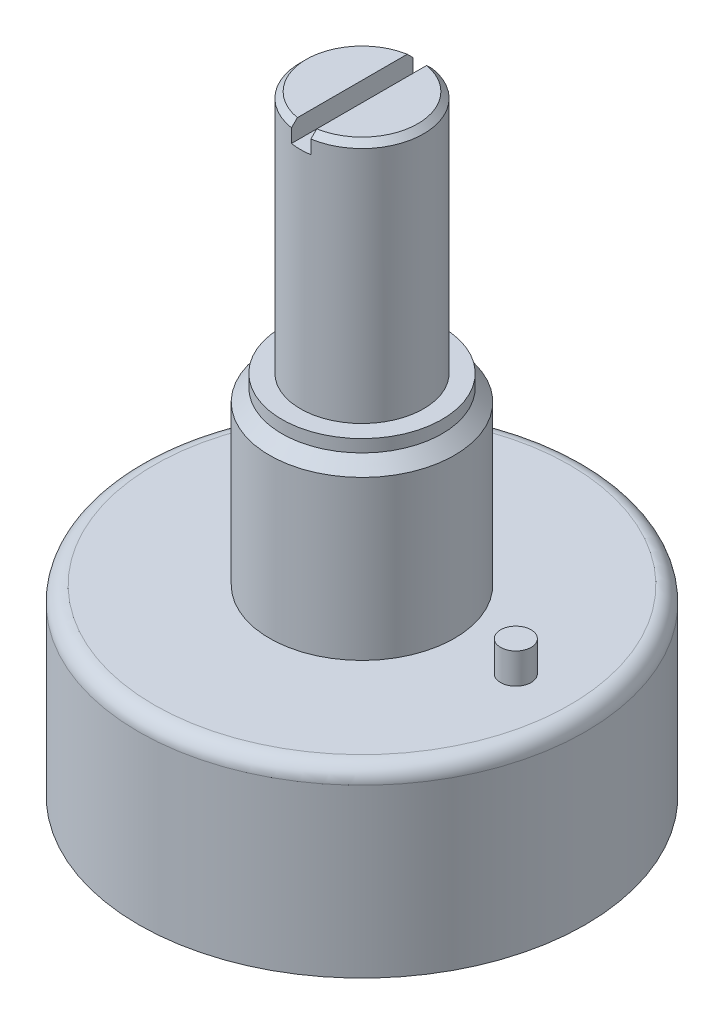
ISO-10303-21;
HEADER;
FILE_DESCRIPTION(('STEP AP214'),'2;1');
FILE_NAME('part.step','',(''),(''),'','','');
FILE_SCHEMA(('AUTOMOTIVE_DESIGN { 1 0 10303 214 1 1 1 1 }'));
ENDSEC;
DATA;
#1=APPLICATION_CONTEXT('core data for automotive mechanical design processes');
#2=APPLICATION_PROTOCOL_DEFINITION('international standard','automotive_design',2000,#1);
#3=PRODUCT_CONTEXT('',#1,'mechanical');
#4=PRODUCT('Part','Part','',(#3));
#5=PRODUCT_RELATED_PRODUCT_CATEGORY('part','',(#4));
#6=PRODUCT_DEFINITION_FORMATION('','',#4);
#7=PRODUCT_DEFINITION_CONTEXT('part definition',#1,'design');
#8=PRODUCT_DEFINITION('design','',#6,#7);
#9=PRODUCT_DEFINITION_SHAPE('','',#8);
#10=(LENGTH_UNIT() NAMED_UNIT(*) SI_UNIT(.MILLI.,.METRE.));
#11=(NAMED_UNIT(*) PLANE_ANGLE_UNIT() SI_UNIT($,.RADIAN.));
#12=(NAMED_UNIT(*) SI_UNIT($,.STERADIAN.) SOLID_ANGLE_UNIT());
#13=UNCERTAINTY_MEASURE_WITH_UNIT(LENGTH_MEASURE(1.E-05),#10,'distance_accuracy_value','');
#14=(GEOMETRIC_REPRESENTATION_CONTEXT(3) GLOBAL_UNCERTAINTY_ASSIGNED_CONTEXT((#13)) GLOBAL_UNIT_ASSIGNED_CONTEXT((#10,
#11,#12)) REPRESENTATION_CONTEXT('',''));
#15=CARTESIAN_POINT('',(0.,0.,0.));
#16=DIRECTION('',(0.,0.,1.));
#17=DIRECTION('',(1.,0.,0.));
#18=AXIS2_PLACEMENT_3D('',#15,#16,#17);
#19=CARTESIAN_POINT('',(0.,31.4,0.));
#20=DIRECTION('',(0.,-1.,0.));
#21=DIRECTION('',(0.,0.,-1.));
#22=AXIS2_PLACEMENT_3D('',#19,#20,#21);
#23=PLANE('',#22);
#24=CARTESIAN_POINT('',(0.,31.4,0.));
#25=DIRECTION('',(0.,-1.,0.));
#26=DIRECTION('',(0.,0.,-1.));
#27=AXIS2_PLACEMENT_3D('',#24,#25,#26);
#28=CIRCLE('',#27,2.87249999999998);
#29=CARTESIAN_POINT('',(-0.5,31.4,-2.82864919175211));
#30=VERTEX_POINT('',#29);
#31=CARTESIAN_POINT('',(-0.5,31.4,2.82864919175211));
#32=VERTEX_POINT('',#31);
#33=EDGE_CURVE('E101',#30,#32,#28,.F.);
#34=ORIENTED_EDGE('',*,*,#33,.T.);
#35=DIRECTION('',(0.,0.,1.));
#36=VECTOR('',#35,1.);
#37=CARTESIAN_POINT('',(-0.5,31.4,3.28597428225304));
#38=LINE('',#37,#36);
#39=EDGE_CURVE('E90',#30,#32,#38,.T.);
#40=ORIENTED_EDGE('',*,*,#39,.F.);
#41=EDGE_LOOP('',(#34,#40));
#42=FACE_BOUND('',#41,.T.);
#43=ADVANCED_FACE('F36',(#42),#23,.F.);
#44=CARTESIAN_POINT('',(0.,31.1,0.));
#45=DIRECTION('',(0.,-1.,0.));
#46=DIRECTION('',(0.,0.,-1.));
#47=AXIS2_PLACEMENT_3D('',#44,#45,#46);
#48=CONICAL_SURFACE('',#47,3.1725,0.785398163397445);
#49=CARTESIAN_POINT('',(-0.5,27.288547056413,-6.96603177700447));
#50=CARTESIAN_POINT('',(-0.5,27.5300039597457,-6.72394862889892));
#51=CARTESIAN_POINT('',(-0.5,27.771433315518,-6.48183798201227));
#52=CARTESIAN_POINT('',(-0.5,28.2542078267142,-5.9975188207773));
#53=CARTESIAN_POINT('',(-0.5,28.4955529795056,-5.75531030380489));
#54=CARTESIAN_POINT('',(-0.5,28.9782776286299,-5.2706042479382));
#55=CARTESIAN_POINT('',(-0.5,29.2196570397063,-5.02810662411767));
#56=CARTESIAN_POINT('',(-0.5,29.7022134935406,-4.54292366184228));
#57=CARTESIAN_POINT('',(-0.5,29.9433905418,-4.30023832885955));
#58=CARTESIAN_POINT('',(-0.5,30.4238625517319,-3.8161367390831));
#59=CARTESIAN_POINT('',(-0.5,30.6631595469871,-3.57472250216536));
#60=CARTESIAN_POINT('',(-0.5,31.0216934581403,-3.21217326344738));
#61=CARTESIAN_POINT('',(-0.5,31.1411413385245,-3.09124694733634));
#62=CARTESIAN_POINT('',(-0.5,31.3798344307671,-2.84919646474488));
#63=CARTESIAN_POINT('',(-0.5,31.4990796443604,-2.72807229997575));
#64=CARTESIAN_POINT('',(-0.5,31.7372267306625,-2.48558553315032));
#65=CARTESIAN_POINT('',(-0.5,31.8561287255236,-2.36422305118749));
#66=CARTESIAN_POINT('',(-0.5,32.0934778662436,-2.12104623578978));
#67=CARTESIAN_POINT('',(-0.5,32.2119249969633,-1.99923188757616));
#68=CARTESIAN_POINT('',(-0.5,32.4480480006189,-1.75489048668165));
#69=CARTESIAN_POINT('',(-0.5,32.5657239876176,-1.63236354470605));
#70=CARTESIAN_POINT('',(-0.5,32.741151467923,-1.44754709102771));
#71=CARTESIAN_POINT('',(-0.5,32.7994446647636,-1.38577226776808));
#72=CARTESIAN_POINT('',(-0.5,32.9154966415272,-1.26172319205674));
#73=CARTESIAN_POINT('',(-0.5,32.9732554319675,-1.19944894947908));
#74=CARTESIAN_POINT('',(-0.5,33.0619346470259,-1.10256782524118));
#75=CARTESIAN_POINT('',(-0.5,33.0931437868164,-1.06822540774064));
#76=CARTESIAN_POINT('',(-0.5,33.1552403987732,-0.999247494692473));
#77=CARTESIAN_POINT('',(-0.5,33.186127855638,-0.964611985343962));
#78=CARTESIAN_POINT('',(-0.5,33.2475411637469,-0.894882169528603));
#79=CARTESIAN_POINT('',(-0.5,33.278066042011,-0.859787004297246));
#80=CARTESIAN_POINT('',(-0.5,33.3385167604402,-0.789089245899828));
#81=CARTESIAN_POINT('',(-0.5,33.3684426687403,-0.753486711246776));
#82=CARTESIAN_POINT('',(-0.5,33.4239970578936,-0.685774653073547));
#83=CARTESIAN_POINT('',(-0.5,33.4497194321187,-0.653742467464993));
#84=CARTESIAN_POINT('',(-0.5,33.500209873413,-0.588936300757677));
#85=CARTESIAN_POINT('',(-0.5,33.5249780769624,-0.55616242681932));
#86=CARTESIAN_POINT('',(-0.5,33.5730721409335,-0.489621331310184));
#87=CARTESIAN_POINT('',(-0.5,33.596399647672,-0.455855311164393));
#88=CARTESIAN_POINT('',(-0.5,33.6408348341534,-0.386908383343045));
#89=CARTESIAN_POINT('',(-0.5,33.6619447838647,-0.351728974494393));
#90=CARTESIAN_POINT('',(-0.5,33.6981438156599,-0.283904257322551));
#91=CARTESIAN_POINT('',(-0.5,33.7136554485617,-0.251490074209695));
#92=CARTESIAN_POINT('',(-0.5,33.7402696284194,-0.184909435055523));
#93=CARTESIAN_POINT('',(-0.5,33.7513848493789,-0.150748341343978));
#94=CARTESIAN_POINT('',(-0.5,33.7657373860242,-0.0870991771249009));
#95=CARTESIAN_POINT('',(-0.5,33.7700232182639,-0.0578586677211615));
#96=CARTESIAN_POINT('',(-0.5,33.7733563825789,0.000907523195942696));
#97=CARTESIAN_POINT('',(-0.5,33.7724095526789,0.0304328502273533));
#98=CARTESIAN_POINT('',(-0.5,33.7655167295567,0.0887201584695105));
#99=CARTESIAN_POINT('',(-0.5,33.7595935146516,0.11748500289242));
#100=CARTESIAN_POINT('',(-0.5,33.7438123198258,0.173922650467285));
#101=CARTESIAN_POINT('',(-0.5,33.7339463524022,0.20159311071396));
#102=CARTESIAN_POINT('',(-0.5,33.7054207568807,0.270216672487378));
#103=CARTESIAN_POINT('',(-0.5,33.684879369701,0.310365635825965));
#104=CARTESIAN_POINT('',(-0.5,33.6400764186486,0.388567737337615));
#105=CARTESIAN_POINT('',(-0.5,33.615804451372,0.426614597103545));
#106=CARTESIAN_POINT('',(-0.5,33.5648318288428,0.501549373047888));
#107=CARTESIAN_POINT('',(-0.5,33.5381105542536,0.538423095660453));
#108=CARTESIAN_POINT('',(-0.5,33.4833104990237,0.611051921840621));
#109=CARTESIAN_POINT('',(-0.5,33.4552336726478,0.646808520182425));
#110=CARTESIAN_POINT('',(-0.5,33.393669800073,0.723138344051769));
#111=CARTESIAN_POINT('',(-0.5,33.3600262966418,0.763584757381936));
#112=CARTESIAN_POINT('',(-0.5,33.2919228337129,0.843786262325022));
#113=CARTESIAN_POINT('',(-0.5,33.2574627975668,0.883541288424836));
#114=CARTESIAN_POINT('',(-0.5,33.1532316596547,1.00209776114756));
#115=CARTESIAN_POINT('',(-0.5,33.0826294694009,1.08016659481256));
#116=CARTESIAN_POINT('',(-0.5,32.9401654433592,1.23532869523354));
#117=CARTESIAN_POINT('',(-0.5,32.8683020448125,1.31242051277037));
#118=CARTESIAN_POINT('',(-0.5,32.7238744451481,1.46591832235309));
#119=CARTESIAN_POINT('',(-0.5,32.6513103723287,1.54232443519188));
#120=CARTESIAN_POINT('',(-0.5,32.5062568807852,1.69413979144439));
#121=CARTESIAN_POINT('',(-0.5,32.4337708058557,1.76955223765962));
#122=CARTESIAN_POINT('',(-0.5,32.2884836271079,1.92007967761313));
#123=CARTESIAN_POINT('',(-0.5,32.2156825087285,1.99519465728884));
#124=CARTESIAN_POINT('',(-0.5,31.9970510964316,2.22011733756257));
#125=CARTESIAN_POINT('',(-0.5,31.8508932072082,2.36960638433859));
#126=CARTESIAN_POINT('',(-0.5,31.5226066767131,2.70429326551709));
#127=CARTESIAN_POINT('',(-0.5,31.3403472655684,2.88936260435475));
#128=CARTESIAN_POINT('',(-0.5,30.9754096072684,3.25909004141369));
#129=CARTESIAN_POINT('',(-0.5,30.7927313573098,3.44374813686612));
#130=CARTESIAN_POINT('',(-0.5,30.2442163996167,3.99745700407354));
#131=CARTESIAN_POINT('',(-0.5,29.8780044215792,4.36613584966918));
#132=CARTESIAN_POINT('',(-0.5,29.1413395544801,5.10688487472396));
#133=CARTESIAN_POINT('',(-0.5,28.7708821118829,5.47895052068311));
#134=CARTESIAN_POINT('',(-0.5,28.0298134335333,6.22270266375583));
#135=CARTESIAN_POINT('',(-0.5,27.6592022790939,6.59438924187605));
#136=CARTESIAN_POINT('',(-0.5,27.288547056413,6.96603177700447));
#137=B_SPLINE_CURVE_WITH_KNOTS('',3,(#49,#50,#51,#52,#53,#54,#55,#56,#57,#58,#59,#60,#61,#62,
#63,#64,#65,#66,#67,#68,#69,#70,#71,#72,#73,#74,#75,#76,#77,#78,#79,#80,#81,#82,#83,#84,#85,#86,
#87,#88,#89,#90,#91,#92,#93,#94,#95,#96,#97,#98,#99,#100,#101,#102,#103,#104,#105,#106,#107,
#108,#109,#110,#111,#112,#113,#114,#115,#116,#117,#118,#119,#120,#121,#122,#123,#124,#125,#126,
#127,#128,#129,#130,#131,#132,#133,#134,#135,#136),.UNSPECIFIED.,.F.,.F.,(4,2,2,2,2,2,2,2,2,2,2,
2,2,2,2,2,2,2,2,2,2,2,2,2,2,2,2,2,2,2,2,2,2,2,2,2,2,2,2,2,2,2,2,4),(0.,1.02574422896252,
2.05151807667026,3.07797893342647,4.10441091666349,5.12416271016263,5.63408285721161,
6.14399861684405,6.65370233825424,7.16342287964467,7.67306624280289,7.9278742770764,
8.18267728588768,8.32189043163663,8.46111016943695,8.60064398553022,8.74016183788523,
8.86339490702947,8.98661028350882,9.10968214938228,9.23262678115715,9.34023855108588,
9.44753779572922,9.53578085263877,9.62392547761077,9.71166882412716,9.79959083572273,
9.93449922665348,10.0697908989564,10.2063498110251,10.3427174088062,10.5005299419243,
10.6583573481386,10.9741057462498,11.2902777212977,11.6063928612655,11.9201933645933,
12.23400852968,12.8612078503918,13.640451616304,14.4197006129891,15.978647158305,
17.5537801263763,19.1284329101131),.UNSPECIFIED.);
#138=CARTESIAN_POINT('',(-0.5,31.1,-3.13285113754229));
#139=VERTEX_POINT('',#138);
#140=EDGE_CURVE('E87',#139,#30,#137,.T.);
#141=ORIENTED_EDGE('',*,*,#140,.F.);
#142=CARTESIAN_POINT('',(0.,31.1,0.));
#143=DIRECTION('',(0.,-1.,0.));
#144=DIRECTION('',(0.,0.,-1.));
#145=AXIS2_PLACEMENT_3D('',#142,#143,#144);
#146=CIRCLE('',#145,3.1725);
#147=CARTESIAN_POINT('',(-0.5,31.1,3.13285113754229));
#148=VERTEX_POINT('',#147);
#149=EDGE_CURVE('E554',#148,#139,#146,.T.);
#150=ORIENTED_EDGE('',*,*,#149,.F.);
#151=EDGE_CURVE('E97',#32,#148,#137,.T.);
#152=ORIENTED_EDGE('',*,*,#151,.F.);
#153=ORIENTED_EDGE('',*,*,#33,.F.);
#154=EDGE_LOOP('',(#141,#150,#152,#153));
#155=FACE_BOUND('',#154,.T.);
#156=ADVANCED_FACE('F104',(#155),#48,.T.);
#157=CARTESIAN_POINT('',(-11.5,0.,0.));
#158=DIRECTION('',(0.,1.,0.));
#159=DIRECTION('',(0.,0.,1.));
#160=AXIS2_PLACEMENT_3D('',#157,#158,#159);
#161=PLANE('',#160);
#162=CARTESIAN_POINT('',(4.5,0.,0.));
#163=DIRECTION('',(0.,1.,0.));
#164=DIRECTION('',(0.,0.,1.));
#165=AXIS2_PLACEMENT_3D('',#162,#163,#164);
#166=CIRCLE('',#165,1.);
#167=CARTESIAN_POINT('',(4.5,0.,1.));
#168=VERTEX_POINT('',#167);
#169=EDGE_CURVE('E11',#168,#168,#166,.F.);
#170=ORIENTED_EDGE('',*,*,#169,.F.);
#171=EDGE_LOOP('',(#170));
#172=FACE_BOUND('',#171,.T.);
#173=CARTESIAN_POINT('',(-3.18198051533948,0.,-3.18198051533946));
#174=DIRECTION('',(0.,1.,0.));
#175=DIRECTION('',(0.,0.,1.));
#176=AXIS2_PLACEMENT_3D('',#173,#174,#175);
#177=CIRCLE('',#176,1.00000000000001);
#178=CARTESIAN_POINT('',(-3.18198051533948,0.,-2.18198051533945));
#179=VERTEX_POINT('',#178);
#180=EDGE_CURVE('E44',#179,#179,#177,.F.);
#181=ORIENTED_EDGE('',*,*,#180,.F.);
#182=EDGE_LOOP('',(#181));
#183=FACE_BOUND('',#182,.T.);
#184=CARTESIAN_POINT('',(-3.18198051533948,0.,3.18198051533946));
#185=DIRECTION('',(0.,1.,0.));
#186=DIRECTION('',(0.,0.,1.));
#187=AXIS2_PLACEMENT_3D('',#184,#185,#186);
#188=CIRCLE('',#187,1.00000000000001);
#189=CARTESIAN_POINT('',(-3.18198051533948,0.,4.18198051533947));
#190=VERTEX_POINT('',#189);
#191=EDGE_CURVE('E654',#190,#190,#188,.F.);
#192=ORIENTED_EDGE('',*,*,#191,.F.);
#193=EDGE_LOOP('',(#192));
#194=FACE_BOUND('',#193,.T.);
#195=CARTESIAN_POINT('',(0.,0.,0.));
#196=DIRECTION('',(0.,-1.,0.));
#197=DIRECTION('',(0.,0.,-1.));
#198=AXIS2_PLACEMENT_3D('',#195,#196,#197);
#199=CIRCLE('',#198,11.5);
#200=CARTESIAN_POINT('',(0.,0.,-11.5));
#201=VERTEX_POINT('',#200);
#202=EDGE_CURVE('E573',#201,#201,#199,.T.);
#203=ORIENTED_EDGE('',*,*,#202,.T.);
#204=EDGE_LOOP('',(#203));
#205=FACE_BOUND('',#204,.T.);
#206=ADVANCED_FACE('F165',(#172,#183,#194,#205),#161,.F.);
#207=CARTESIAN_POINT('',(0.5,31.4,2.82864919175211));
#208=VERTEX_POINT('',#207);
#209=CARTESIAN_POINT('',(0.5,31.4,-2.82864919175211));
#210=VERTEX_POINT('',#209);
#211=EDGE_CURVE('E106',#208,#210,#28,.F.);
#212=ORIENTED_EDGE('',*,*,#211,.T.);
#213=DIRECTION('',(0.,0.,-1.));
#214=VECTOR('',#213,1.);
#215=CARTESIAN_POINT('',(0.5,31.4,3.28597428225304));
#216=LINE('',#215,#214);
#217=EDGE_CURVE('E51',#208,#210,#216,.T.);
#218=ORIENTED_EDGE('',*,*,#217,.F.);
#219=EDGE_LOOP('',(#212,#218));
#220=FACE_BOUND('',#219,.T.);
#221=ADVANCED_FACE('F162',(#220),#23,.F.);
#222=CARTESIAN_POINT('',(0.,0.,0.));
#223=DIRECTION('',(0.,-1.,0.));
#224=DIRECTION('',(0.,0.,-1.));
#225=AXIS2_PLACEMENT_3D('',#222,#223,#224);
#226=CYLINDRICAL_SURFACE('',#225,3.1725);
#227=ORIENTED_EDGE('',*,*,#149,.T.);
#228=DIRECTION('',(0.,-1.,0.));
#229=VECTOR('',#228,1.);
#230=CARTESIAN_POINT('',(-0.5,0.,-3.13285113754229));
#231=LINE('',#230,#229);
#232=CARTESIAN_POINT('',(-0.5,30.4,-3.13285113754229));
#233=VERTEX_POINT('',#232);
#234=EDGE_CURVE('E59',#139,#233,#231,.T.);
#235=ORIENTED_EDGE('',*,*,#234,.T.);
#236=CARTESIAN_POINT('',(0.,30.4,0.));
#237=DIRECTION('',(0.,1.,0.));
#238=DIRECTION('',(0.,0.,1.));
#239=AXIS2_PLACEMENT_3D('',#236,#237,#238);
#240=CIRCLE('',#239,3.1725);
#241=CARTESIAN_POINT('',(0.5,30.4,-3.13285113754229));
#242=VERTEX_POINT('',#241);
#243=EDGE_CURVE('E666',#242,#233,#240,.T.);
#244=ORIENTED_EDGE('',*,*,#243,.F.);
#245=DIRECTION('',(0.,-1.,0.));
#246=VECTOR('',#245,1.);
#247=CARTESIAN_POINT('',(0.5,0.,-3.13285113754229));
#248=LINE('',#247,#246);
#249=CARTESIAN_POINT('',(0.5,31.1,-3.13285113754229));
#250=VERTEX_POINT('',#249);
#251=EDGE_CURVE('E553',#242,#250,#248,.F.);
#252=ORIENTED_EDGE('',*,*,#251,.T.);
#253=CARTESIAN_POINT('',(0.5,31.1,3.13285113754229));
#254=VERTEX_POINT('',#253);
#255=EDGE_CURVE('E111',#250,#254,#146,.T.);
#256=ORIENTED_EDGE('',*,*,#255,.T.);
#257=DIRECTION('',(0.,-1.,0.));
#258=VECTOR('',#257,1.);
#259=CARTESIAN_POINT('',(0.5,0.,3.13285113754229));
#260=LINE('',#259,#258);
#261=CARTESIAN_POINT('',(0.5,30.4,3.13285113754229));
#262=VERTEX_POINT('',#261);
#263=EDGE_CURVE('E551',#254,#262,#260,.T.);
#264=ORIENTED_EDGE('',*,*,#263,.T.);
#265=CARTESIAN_POINT('',(-0.5,30.4,3.13285113754229));
#266=VERTEX_POINT('',#265);
#267=EDGE_CURVE('E96',#266,#262,#240,.T.);
#268=ORIENTED_EDGE('',*,*,#267,.F.);
#269=DIRECTION('',(0.,-1.,0.));
#270=VECTOR('',#269,1.);
#271=CARTESIAN_POINT('',(-0.5,0.,3.13285113754229));
#272=LINE('',#271,#270);
#273=EDGE_CURVE('E577',#266,#148,#272,.F.);
#274=ORIENTED_EDGE('',*,*,#273,.T.);
#275=EDGE_LOOP('',(#227,#235,#244,#252,#256,#264,#268,#274));
#276=FACE_BOUND('',#275,.T.);
#277=CARTESIAN_POINT('',(0.,18.84,0.));
#278=DIRECTION('',(0.,-1.,0.));
#279=DIRECTION('',(0.,0.,-1.));
#280=AXIS2_PLACEMENT_3D('',#277,#278,#279);
#281=CIRCLE('',#280,3.1725);
#282=CARTESIAN_POINT('',(0.,18.84,-3.1725));
#283=VERTEX_POINT('',#282);
#284=EDGE_CURVE('E555',#283,#283,#281,.T.);
#285=ORIENTED_EDGE('',*,*,#284,.F.);
#286=EDGE_LOOP('',(#285));
#287=FACE_BOUND('',#286,.T.);
#288=ADVANCED_FACE('F158',(#276,#287),#226,.T.);
#289=CARTESIAN_POINT('',(-3.1725,18.84,0.));
#290=DIRECTION('',(0.,-1.,0.));
#291=DIRECTION('',(0.,0.,-1.));
#292=AXIS2_PLACEMENT_3D('',#289,#290,#291);
#293=PLANE('',#292);
#294=CARTESIAN_POINT('',(0.,18.84,0.));
#295=DIRECTION('',(0.,-1.,0.));
#296=DIRECTION('',(0.,0.,-1.));
#297=AXIS2_PLACEMENT_3D('',#294,#295,#296);
#298=CIRCLE('',#297,4.12249999999999);
#299=CARTESIAN_POINT('',(0.,18.84,-4.12249999999999));
#300=VERTEX_POINT('',#299);
#301=EDGE_CURVE('E558',#300,#300,#298,.T.);
#302=ORIENTED_EDGE('',*,*,#301,.F.);
#303=EDGE_LOOP('',(#302));
#304=FACE_BOUND('',#303,.T.);
#305=ORIENTED_EDGE('',*,*,#284,.T.);
#306=EDGE_LOOP('',(#305));
#307=FACE_BOUND('',#306,.T.);
#308=ADVANCED_FACE('F154',(#304,#307),#293,.F.);
#309=CARTESIAN_POINT('',(0.,0.,0.));
#310=DIRECTION('',(0.,-1.,0.));
#311=DIRECTION('',(0.,0.,-1.));
#312=AXIS2_PLACEMENT_3D('',#309,#310,#311);
#313=CYLINDRICAL_SURFACE('',#312,4.12249999999999);
#314=CARTESIAN_POINT('',(0.,18.2,0.));
#315=DIRECTION('',(0.,-1.,0.));
#316=DIRECTION('',(0.,0.,-1.));
#317=AXIS2_PLACEMENT_3D('',#314,#315,#316);
#318=CIRCLE('',#317,4.12249999999999);
#319=CARTESIAN_POINT('',(0.,18.2,-4.12249999999999));
#320=VERTEX_POINT('',#319);
#321=EDGE_CURVE('E562',#320,#320,#318,.T.);
#322=ORIENTED_EDGE('',*,*,#321,.F.);
#323=EDGE_LOOP('',(#322));
#324=FACE_BOUND('',#323,.T.);
#325=ORIENTED_EDGE('',*,*,#301,.T.);
#326=EDGE_LOOP('',(#325));
#327=FACE_BOUND('',#326,.T.);
#328=ADVANCED_FACE('F150',(#324,#327),#313,.T.);
#329=CARTESIAN_POINT('',(0.,18.2,0.));
#330=DIRECTION('',(0.,-1.,0.));
#331=DIRECTION('',(0.,0.,-1.));
#332=AXIS2_PLACEMENT_3D('',#329,#330,#331);
#333=CONICAL_SURFACE('',#332,4.12249999999999,0.785398163397452);
#334=CARTESIAN_POINT('',(0.,17.56,0.));
#335=DIRECTION('',(0.,-1.,0.));
#336=DIRECTION('',(0.,0.,-1.));
#337=AXIS2_PLACEMENT_3D('',#334,#335,#336);
#338=CIRCLE('',#337,4.7625);
#339=CARTESIAN_POINT('',(0.,17.56,-4.7625));
#340=VERTEX_POINT('',#339);
#341=EDGE_CURVE('E567',#340,#340,#338,.T.);
#342=ORIENTED_EDGE('',*,*,#341,.F.);
#343=EDGE_LOOP('',(#342));
#344=FACE_BOUND('',#343,.T.);
#345=ORIENTED_EDGE('',*,*,#321,.T.);
#346=EDGE_LOOP('',(#345));
#347=FACE_BOUND('',#346,.T.);
#348=ADVANCED_FACE('F146',(#344,#347),#333,.T.);
#349=CARTESIAN_POINT('',(0.,0.,0.));
#350=DIRECTION('',(0.,-1.,0.));
#351=DIRECTION('',(0.,0.,-1.));
#352=AXIS2_PLACEMENT_3D('',#349,#350,#351);
#353=CYLINDRICAL_SURFACE('',#352,4.7625);
#354=CARTESIAN_POINT('',(0.,9.4,0.));
#355=DIRECTION('',(0.,-1.,0.));
#356=DIRECTION('',(0.,0.,-1.));
#357=AXIS2_PLACEMENT_3D('',#354,#355,#356);
#358=CIRCLE('',#357,4.7625);
#359=CARTESIAN_POINT('',(0.,9.4,-4.7625));
#360=VERTEX_POINT('',#359);
#361=EDGE_CURVE('E570',#360,#360,#358,.T.);
#362=ORIENTED_EDGE('',*,*,#361,.F.);
#363=EDGE_LOOP('',(#362));
#364=FACE_BOUND('',#363,.T.);
#365=ORIENTED_EDGE('',*,*,#341,.T.);
#366=EDGE_LOOP('',(#365));
#367=FACE_BOUND('',#366,.T.);
#368=ADVANCED_FACE('F142',(#364,#367),#353,.T.);
#369=CARTESIAN_POINT('',(-4.7625,9.4,0.));
#370=DIRECTION('',(0.,-1.,0.));
#371=DIRECTION('',(0.,0.,-1.));
#372=AXIS2_PLACEMENT_3D('',#369,#370,#371);
#373=PLANE('',#372);
#374=CARTESIAN_POINT('',(7.92,9.4,0.));
#375=DIRECTION('',(0.,-1.,0.));
#376=DIRECTION('',(0.,0.,-1.));
#377=AXIS2_PLACEMENT_3D('',#374,#375,#376);
#378=CIRCLE('',#377,0.784999999999999);
#379=CARTESIAN_POINT('',(7.92,9.4,-0.784999999999999));
#380=VERTEX_POINT('',#379);
#381=EDGE_CURVE('E656',#380,#380,#378,.F.);
#382=ORIENTED_EDGE('',*,*,#381,.F.);
#383=EDGE_LOOP('',(#382));
#384=FACE_BOUND('',#383,.T.);
#385=CARTESIAN_POINT('',(0.,9.4,0.));
#386=DIRECTION('',(0.,-1.,0.));
#387=DIRECTION('',(0.,0.,-1.));
#388=AXIS2_PLACEMENT_3D('',#385,#386,#387);
#389=CIRCLE('',#388,10.7);
#390=CARTESIAN_POINT('',(0.,9.4,-10.7));
#391=VERTEX_POINT('',#390);
#392=EDGE_CURVE('E661',#391,#391,#389,.F.);
#393=ORIENTED_EDGE('',*,*,#392,.T.);
#394=EDGE_LOOP('',(#393));
#395=FACE_BOUND('',#394,.T.);
#396=ORIENTED_EDGE('',*,*,#361,.T.);
#397=EDGE_LOOP('',(#396));
#398=FACE_BOUND('',#397,.T.);
#399=ADVANCED_FACE('F138',(#384,#395,#398),#373,.F.);
#400=CARTESIAN_POINT('',(0.,0.,0.));
#401=DIRECTION('',(0.,-1.,0.));
#402=DIRECTION('',(0.,0.,-1.));
#403=AXIS2_PLACEMENT_3D('',#400,#401,#402);
#404=CYLINDRICAL_SURFACE('',#403,11.5);
#405=CARTESIAN_POINT('',(0.,8.6,0.));
#406=DIRECTION('',(0.,-1.,0.));
#407=DIRECTION('',(0.,0.,-1.));
#408=AXIS2_PLACEMENT_3D('',#405,#406,#407);
#409=CIRCLE('',#408,11.5);
#410=CARTESIAN_POINT('',(0.,8.6,-11.5));
#411=VERTEX_POINT('',#410);
#412=EDGE_CURVE('E664',#411,#411,#409,.T.);
#413=ORIENTED_EDGE('',*,*,#412,.T.);
#414=EDGE_LOOP('',(#413));
#415=FACE_BOUND('',#414,.T.);
#416=ORIENTED_EDGE('',*,*,#202,.F.);
#417=EDGE_LOOP('',(#416));
#418=FACE_BOUND('',#417,.T.);
#419=ADVANCED_FACE('F135',(#415,#418),#404,.T.);
#420=CARTESIAN_POINT('',(0.5,27.2885470564131,6.96603177700447));
#421=CARTESIAN_POINT('',(0.5,27.5300039597457,6.72394862889892));
#422=CARTESIAN_POINT('',(0.5,27.771433315518,6.48183798201227));
#423=CARTESIAN_POINT('',(0.5,28.2542078267143,5.99751882077729));
#424=CARTESIAN_POINT('',(0.5,28.4955529795056,5.75531030380488));
#425=CARTESIAN_POINT('',(0.5,28.9782776286299,5.27060424793819));
#426=CARTESIAN_POINT('',(0.5,29.2196570397063,5.02810662411766));
#427=CARTESIAN_POINT('',(0.5,29.7022134935406,4.54292366184226));
#428=CARTESIAN_POINT('',(0.5,29.9433905418,4.30023832885954));
#429=CARTESIAN_POINT('',(0.5,30.4238625517319,3.81613673908309));
#430=CARTESIAN_POINT('',(0.5,30.6631595469871,3.57472250216535));
#431=CARTESIAN_POINT('',(0.5,31.0216934581403,3.21217326344736));
#432=CARTESIAN_POINT('',(0.5,31.1411413385245,3.09124694733632));
#433=CARTESIAN_POINT('',(0.5,31.3798344307671,2.84919646474487));
#434=CARTESIAN_POINT('',(0.5,31.4990796443604,2.72807229997575));
#435=CARTESIAN_POINT('',(0.5,31.7372267306625,2.48558553315031));
#436=CARTESIAN_POINT('',(0.5,31.8561287255236,2.36422305118749));
#437=CARTESIAN_POINT('',(0.5,32.0934778662436,2.12104623578977));
#438=CARTESIAN_POINT('',(0.5,32.2119249969633,1.99923188757615));
#439=CARTESIAN_POINT('',(0.5,32.4480480006189,1.75489048668164));
#440=CARTESIAN_POINT('',(0.5,32.5657239876176,1.63236354470605));
#441=CARTESIAN_POINT('',(0.5,32.741151467923,1.44754709102771));
#442=CARTESIAN_POINT('',(0.5,32.7994446647636,1.38577226776808));
#443=CARTESIAN_POINT('',(0.5,32.9154966415272,1.26172319205674));
#444=CARTESIAN_POINT('',(0.5,32.9732554319675,1.19944894947907));
#445=CARTESIAN_POINT('',(0.5,33.0619346470259,1.10256782524118));
#446=CARTESIAN_POINT('',(0.5,33.0931437868164,1.06822540774064));
#447=CARTESIAN_POINT('',(0.5,33.1552403987732,0.999247494692473));
#448=CARTESIAN_POINT('',(0.5,33.186127855638,0.964611985343962));
#449=CARTESIAN_POINT('',(0.5,33.2475411637469,0.894882169528604));
#450=CARTESIAN_POINT('',(0.5,33.278066042011,0.859787004297247));
#451=CARTESIAN_POINT('',(0.5,33.3385167604402,0.789089245899828));
#452=CARTESIAN_POINT('',(0.5,33.3684426687403,0.753486711246776));
#453=CARTESIAN_POINT('',(0.5,33.4239970578936,0.685774653073546));
#454=CARTESIAN_POINT('',(0.5,33.4497194321187,0.653742467464993));
#455=CARTESIAN_POINT('',(0.5,33.500209873413,0.588936300757677));
#456=CARTESIAN_POINT('',(0.5,33.5249780769624,0.55616242681932));
#457=CARTESIAN_POINT('',(0.5,33.5730721409335,0.489621331310183));
#458=CARTESIAN_POINT('',(0.5,33.596399647672,0.455855311164391));
#459=CARTESIAN_POINT('',(0.5,33.6408348341534,0.386908383343043));
#460=CARTESIAN_POINT('',(0.5,33.6619447838647,0.351728974494392));
#461=CARTESIAN_POINT('',(0.5,33.6981438156599,0.283904257322552));
#462=CARTESIAN_POINT('',(0.5,33.7136554485617,0.251490074209696));
#463=CARTESIAN_POINT('',(0.5,33.7402696284194,0.184909435055525));
#464=CARTESIAN_POINT('',(0.5,33.7513848493789,0.150748341343979));
#465=CARTESIAN_POINT('',(0.5,33.7657373860242,0.0870991771249028));
#466=CARTESIAN_POINT('',(0.5,33.7700232182639,0.057858667721164));
#467=CARTESIAN_POINT('',(0.5,33.7733563825789,-0.000907523195939907));
#468=CARTESIAN_POINT('',(0.5,33.7724095526789,-0.0304328502273507));
#469=CARTESIAN_POINT('',(0.5,33.7655167295567,-0.088720158469508));
#470=CARTESIAN_POINT('',(0.5,33.7595935146516,-0.117485002892417));
#471=CARTESIAN_POINT('',(0.5,33.7438123198258,-0.173922650467283));
#472=CARTESIAN_POINT('',(0.5,33.7339463524022,-0.201593110713958));
#473=CARTESIAN_POINT('',(0.5,33.7054207568807,-0.270216672487377));
#474=CARTESIAN_POINT('',(0.5,33.684879369701,-0.310365635825965));
#475=CARTESIAN_POINT('',(0.5,33.6400764186486,-0.388567737337614));
#476=CARTESIAN_POINT('',(0.5,33.615804451372,-0.426614597103544));
#477=CARTESIAN_POINT('',(0.5,33.5648318288428,-0.501549373047887));
#478=CARTESIAN_POINT('',(0.5,33.5381105542536,-0.538423095660452));
#479=CARTESIAN_POINT('',(0.5,33.4833104990237,-0.61105192184062));
#480=CARTESIAN_POINT('',(0.5,33.4552336726478,-0.646808520182423));
#481=CARTESIAN_POINT('',(0.5,33.393669800073,-0.723138344051767));
#482=CARTESIAN_POINT('',(0.5,33.3600262966418,-0.763584757381935));
#483=CARTESIAN_POINT('',(0.5,33.2919228337129,-0.84378626232502));
#484=CARTESIAN_POINT('',(0.5,33.2574627975668,-0.883541288424834));
#485=CARTESIAN_POINT('',(0.5,33.1532316596547,-1.00209776114756));
#486=CARTESIAN_POINT('',(0.5,33.0826294694009,-1.08016659481256));
#487=CARTESIAN_POINT('',(0.5,32.9401654433592,-1.23532869523353));
#488=CARTESIAN_POINT('',(0.5,32.8683020448125,-1.31242051277035));
#489=CARTESIAN_POINT('',(0.5,32.7238744451481,-1.46591832235308));
#490=CARTESIAN_POINT('',(0.5,32.6513103723288,-1.54232443519186));
#491=CARTESIAN_POINT('',(0.5,32.5062568807852,-1.69413979144438));
#492=CARTESIAN_POINT('',(0.5,32.4337708058558,-1.76955223765962));
#493=CARTESIAN_POINT('',(0.5,32.2884836271079,-1.92007967761312));
#494=CARTESIAN_POINT('',(0.5,32.2156825087285,-1.99519465728883));
#495=CARTESIAN_POINT('',(0.5,31.9970510964316,-2.22011733756256));
#496=CARTESIAN_POINT('',(0.5,31.8508932072082,-2.36960638433857));
#497=CARTESIAN_POINT('',(0.5,31.5226066767131,-2.70429326551707));
#498=CARTESIAN_POINT('',(0.5,31.3403472655684,-2.88936260435473));
#499=CARTESIAN_POINT('',(0.5,30.9754096072684,-3.25909004141368));
#500=CARTESIAN_POINT('',(0.5,30.7927313573098,-3.44374813686611));
#501=CARTESIAN_POINT('',(0.5,30.2442163996167,-3.99745700407353));
#502=CARTESIAN_POINT('',(0.5,29.8780044215792,-4.36613584966917));
#503=CARTESIAN_POINT('',(0.5,29.1413395544801,-5.10688487472395));
#504=CARTESIAN_POINT('',(0.5,28.7708821118829,-5.4789505206831));
#505=CARTESIAN_POINT('',(0.5,28.0298134335333,-6.22270266375583));
#506=CARTESIAN_POINT('',(0.5,27.6592022790939,-6.59438924187605));
#507=CARTESIAN_POINT('',(0.5,27.2885470564131,-6.96603177700447));
#508=B_SPLINE_CURVE_WITH_KNOTS('',3,(#420,#421,#422,#423,#424,#425,#426,#427,#428,#429,#430,
#431,#432,#433,#434,#435,#436,#437,#438,#439,#440,#441,#442,#443,#444,#445,#446,#447,#448,#449,
#450,#451,#452,#453,#454,#455,#456,#457,#458,#459,#460,#461,#462,#463,#464,#465,#466,#467,#468,
#469,#470,#471,#472,#473,#474,#475,#476,#477,#478,#479,#480,#481,#482,#483,#484,#485,#486,#487,
#488,#489,#490,#491,#492,#493,#494,#495,#496,#497,#498,#499,#500,#501,#502,#503,#504,#505,#506,
#507),.UNSPECIFIED.,.F.,.F.,(4,2,2,2,2,2,2,2,2,2,2,2,2,2,2,2,2,2,2,2,2,2,2,2,2,2,2,2,2,2,2,2,2,
2,2,2,2,2,2,2,2,2,2,4),(0.,1.02574422896253,2.05151807667027,3.07797893342649,4.10441091666351,
5.12416271016265,5.63408285721162,6.14399861684406,6.65370233825425,7.16342287964468,
7.6730662428029,7.9278742770764,8.18267728588768,8.32189043163663,8.46111016943695,
8.60064398553022,8.74016183788523,8.86339490702946,8.98661028350881,9.10968214938228,
9.23262678115714,9.34023855108587,9.44753779572921,9.53578085263877,9.62392547761076,
9.71166882412715,9.79959083572273,9.93449922665347,10.0697908989564,10.2063498110251,
10.3427174088062,10.5005299419243,10.6583573481386,10.9741057462498,11.2902777212977,
11.6063928612655,11.9201933645932,12.23400852968,12.8612078503918,13.640451616304,
14.4197006129891,15.978647158305,17.5537801263763,19.1284329101131),.UNSPECIFIED.);
#509=EDGE_CURVE('E108',#254,#208,#508,.T.);
#510=ORIENTED_EDGE('',*,*,#509,.F.);
#511=ORIENTED_EDGE('',*,*,#255,.F.);
#512=EDGE_CURVE('E105',#210,#250,#508,.T.);
#513=ORIENTED_EDGE('',*,*,#512,.F.);
#514=ORIENTED_EDGE('',*,*,#211,.F.);
#515=EDGE_LOOP('',(#510,#511,#513,#514));
#516=FACE_BOUND('',#515,.T.);
#517=ADVANCED_FACE('F123',(#516),#48,.T.);
#518=CARTESIAN_POINT('',(0.,30.4,0.));
#519=DIRECTION('',(0.,1.,0.));
#520=DIRECTION('',(0.,0.,1.));
#521=AXIS2_PLACEMENT_3D('',#518,#519,#520);
#522=PLANE('',#521);
#523=ORIENTED_EDGE('',*,*,#243,.T.);
#524=DIRECTION('',(0.,0.,1.));
#525=VECTOR('',#524,1.);
#526=CARTESIAN_POINT('',(-0.5,30.4,3.28597428225304));
#527=LINE('',#526,#525);
#528=EDGE_CURVE('E582',#233,#266,#527,.T.);
#529=ORIENTED_EDGE('',*,*,#528,.T.);
#530=ORIENTED_EDGE('',*,*,#267,.T.);
#531=DIRECTION('',(0.,0.,-1.));
#532=VECTOR('',#531,1.);
#533=CARTESIAN_POINT('',(0.5,30.4,3.28597428225304));
#534=LINE('',#533,#532);
#535=EDGE_CURVE('E581',#262,#242,#534,.T.);
#536=ORIENTED_EDGE('',*,*,#535,.T.);
#537=EDGE_LOOP('',(#523,#529,#530,#536));
#538=FACE_BOUND('',#537,.T.);
#539=ADVANCED_FACE('F130',(#538),#522,.T.);
#540=CARTESIAN_POINT('',(-0.5,30.4,3.28597428225304));
#541=DIRECTION('',(-1.,0.,0.));
#542=DIRECTION('',(0.,0.,1.));
#543=AXIS2_PLACEMENT_3D('',#540,#541,#542);
#544=PLANE('',#543);
#545=ORIENTED_EDGE('',*,*,#140,.T.);
#546=ORIENTED_EDGE('',*,*,#39,.T.);
#547=ORIENTED_EDGE('',*,*,#151,.T.);
#548=ORIENTED_EDGE('',*,*,#273,.F.);
#549=ORIENTED_EDGE('',*,*,#528,.F.);
#550=ORIENTED_EDGE('',*,*,#234,.F.);
#551=EDGE_LOOP('',(#545,#546,#547,#548,#549,#550));
#552=FACE_BOUND('',#551,.T.);
#553=ADVANCED_FACE('F89',(#552),#544,.F.);
#554=CARTESIAN_POINT('',(0.5,30.4,3.28597428225304));
#555=DIRECTION('',(1.,0.,0.));
#556=DIRECTION('',(0.,0.,-1.));
#557=AXIS2_PLACEMENT_3D('',#554,#555,#556);
#558=PLANE('',#557);
#559=ORIENTED_EDGE('',*,*,#509,.T.);
#560=ORIENTED_EDGE('',*,*,#217,.T.);
#561=ORIENTED_EDGE('',*,*,#512,.T.);
#562=ORIENTED_EDGE('',*,*,#251,.F.);
#563=ORIENTED_EDGE('',*,*,#535,.F.);
#564=ORIENTED_EDGE('',*,*,#263,.F.);
#565=EDGE_LOOP('',(#559,#560,#561,#562,#563,#564));
#566=FACE_BOUND('',#565,.T.);
#567=ADVANCED_FACE('F126',(#566),#558,.F.);
#568=CARTESIAN_POINT('',(0.,8.6,0.));
#569=DIRECTION('',(0.,-1.,0.));
#570=DIRECTION('',(0.,0.,-1.));
#571=AXIS2_PLACEMENT_3D('',#568,#569,#570);
#572=TOROIDAL_SURFACE('',#571,10.7,0.8);
#573=ORIENTED_EDGE('',*,*,#392,.F.);
#574=EDGE_LOOP('',(#573));
#575=FACE_BOUND('',#574,.T.);
#576=ORIENTED_EDGE('',*,*,#412,.F.);
#577=EDGE_LOOP('',(#576));
#578=FACE_BOUND('',#577,.T.);
#579=ADVANCED_FACE('F38',(#575,#578),#572,.T.);
#580=CARTESIAN_POINT('',(7.92,10.97,0.));
#581=DIRECTION('',(0.,-1.,0.));
#582=DIRECTION('',(0.,0.,-1.));
#583=AXIS2_PLACEMENT_3D('',#580,#581,#582);
#584=CYLINDRICAL_SURFACE('',#583,0.784999999999999);
#585=CARTESIAN_POINT('',(7.92,10.97,0.));
#586=DIRECTION('',(0.,1.,0.));
#587=DIRECTION('',(0.,0.,1.));
#588=AXIS2_PLACEMENT_3D('',#585,#586,#587);
#589=CIRCLE('',#588,0.784999999999999);
#590=CARTESIAN_POINT('',(7.92,10.97,0.784999999999999));
#591=VERTEX_POINT('',#590);
#592=EDGE_CURVE('E102',#591,#591,#589,.T.);
#593=ORIENTED_EDGE('',*,*,#592,.F.);
#594=EDGE_LOOP('',(#593));
#595=FACE_BOUND('',#594,.T.);
#596=ORIENTED_EDGE('',*,*,#381,.T.);
#597=EDGE_LOOP('',(#596));
#598=FACE_BOUND('',#597,.T.);
#599=ADVANCED_FACE('F251',(#595,#598),#584,.T.);
#600=CARTESIAN_POINT('',(7.92,10.97,0.));
#601=DIRECTION('',(0.,1.,0.));
#602=DIRECTION('',(0.,0.,1.));
#603=AXIS2_PLACEMENT_3D('',#600,#601,#602);
#604=PLANE('',#603);
#605=ORIENTED_EDGE('',*,*,#592,.T.);
#606=EDGE_LOOP('',(#605));
#607=FACE_BOUND('',#606,.T.);
#608=ADVANCED_FACE('F258',(#607),#604,.T.);
#609=CARTESIAN_POINT('',(-3.18198051533948,-0.6,3.18198051533946));
#610=DIRECTION('',(0.,1.,0.));
#611=DIRECTION('',(0.,0.,1.));
#612=AXIS2_PLACEMENT_3D('',#609,#610,#611);
#613=CYLINDRICAL_SURFACE('',#612,1.00000000000001);
#614=CARTESIAN_POINT('',(-3.18198051533948,-0.6,3.18198051533946));
#615=DIRECTION('',(0.,-1.,0.));
#616=DIRECTION('',(0.,0.,-1.));
#617=AXIS2_PLACEMENT_3D('',#614,#615,#616);
#618=CIRCLE('',#617,1.00000000000001);
#619=CARTESIAN_POINT('',(-3.18198051533948,-0.6,2.18198051533944));
#620=VERTEX_POINT('',#619);
#621=EDGE_CURVE('E590',#620,#620,#618,.T.);
#622=ORIENTED_EDGE('',*,*,#621,.F.);
#623=EDGE_LOOP('',(#622));
#624=FACE_BOUND('',#623,.T.);
#625=ORIENTED_EDGE('',*,*,#191,.T.);
#626=EDGE_LOOP('',(#625));
#627=FACE_BOUND('',#626,.T.);
#628=ADVANCED_FACE('F262',(#624,#627),#613,.T.);
#629=CARTESIAN_POINT('',(0.,-0.6,0.));
#630=DIRECTION('',(0.,-1.,0.));
#631=DIRECTION('',(0.,0.,-1.));
#632=AXIS2_PLACEMENT_3D('',#629,#630,#631);
#633=PLANE('',#632);
#634=CARTESIAN_POINT('',(-3.18198051533948,-0.6,3.18198051533946));
#635=DIRECTION('',(0.,-1.,0.));
#636=DIRECTION('',(0.,0.,-1.));
#637=AXIS2_PLACEMENT_3D('',#634,#635,#636);
#638=CIRCLE('',#637,0.7);
#639=CARTESIAN_POINT('',(-3.18198051533948,-0.6,2.48198051533946));
#640=VERTEX_POINT('',#639);
#641=EDGE_CURVE('E600',#640,#640,#638,.T.);
#642=ORIENTED_EDGE('',*,*,#641,.F.);
#643=EDGE_LOOP('',(#642));
#644=FACE_BOUND('',#643,.T.);
#645=ORIENTED_EDGE('',*,*,#621,.T.);
#646=EDGE_LOOP('',(#645));
#647=FACE_BOUND('',#646,.T.);
#648=ADVANCED_FACE('F406',(#644,#647),#633,.T.);
#649=CARTESIAN_POINT('',(-3.18198051533948,-0.6,-3.18198051533946));
#650=DIRECTION('',(0.,1.,0.));
#651=DIRECTION('',(0.,0.,1.));
#652=AXIS2_PLACEMENT_3D('',#649,#650,#651);
#653=CYLINDRICAL_SURFACE('',#652,1.00000000000001);
#654=CARTESIAN_POINT('',(-3.18198051533948,-0.6,-3.18198051533946));
#655=DIRECTION('',(0.,-1.,0.));
#656=DIRECTION('',(0.,0.,-1.));
#657=AXIS2_PLACEMENT_3D('',#654,#655,#656);
#658=CIRCLE('',#657,1.00000000000001);
#659=CARTESIAN_POINT('',(-3.18198051533948,-0.6,-4.18198051533947));
#660=VERTEX_POINT('',#659);
#661=EDGE_CURVE('E593',#660,#660,#658,.T.);
#662=ORIENTED_EDGE('',*,*,#661,.F.);
#663=EDGE_LOOP('',(#662));
#664=FACE_BOUND('',#663,.T.);
#665=ORIENTED_EDGE('',*,*,#180,.T.);
#666=EDGE_LOOP('',(#665));
#667=FACE_BOUND('',#666,.T.);
#668=ADVANCED_FACE('F397',(#664,#667),#653,.T.);
#669=CARTESIAN_POINT('',(0.,-0.6,0.));
#670=DIRECTION('',(0.,-1.,0.));
#671=DIRECTION('',(0.,0.,-1.));
#672=AXIS2_PLACEMENT_3D('',#669,#670,#671);
#673=PLANE('',#672);
#674=CARTESIAN_POINT('',(-3.18198051533948,-0.6,-3.18198051533946));
#675=DIRECTION('',(0.,-1.,0.));
#676=DIRECTION('',(0.,0.,-1.));
#677=AXIS2_PLACEMENT_3D('',#674,#675,#676);
#678=CIRCLE('',#677,0.7);
#679=CARTESIAN_POINT('',(-3.18198051533948,-0.6,-3.88198051533946));
#680=VERTEX_POINT('',#679);
#681=EDGE_CURVE('E612',#680,#680,#678,.T.);
#682=ORIENTED_EDGE('',*,*,#681,.F.);
#683=EDGE_LOOP('',(#682));
#684=FACE_BOUND('',#683,.T.);
#685=ORIENTED_EDGE('',*,*,#661,.T.);
#686=EDGE_LOOP('',(#685));
#687=FACE_BOUND('',#686,.T.);
#688=ADVANCED_FACE('F332',(#684,#687),#673,.T.);
#689=CARTESIAN_POINT('',(4.5,-0.6,0.));
#690=DIRECTION('',(0.,1.,0.));
#691=DIRECTION('',(0.,0.,1.));
#692=AXIS2_PLACEMENT_3D('',#689,#690,#691);
#693=CYLINDRICAL_SURFACE('',#692,1.);
#694=CARTESIAN_POINT('',(4.5,-0.6,0.));
#695=DIRECTION('',(0.,-1.,0.));
#696=DIRECTION('',(0.,0.,-1.));
#697=AXIS2_PLACEMENT_3D('',#694,#695,#696);
#698=CIRCLE('',#697,1.);
#699=CARTESIAN_POINT('',(4.5,-0.6,-1.));
#700=VERTEX_POINT('',#699);
#701=EDGE_CURVE('E596',#700,#700,#698,.T.);
#702=ORIENTED_EDGE('',*,*,#701,.F.);
#703=EDGE_LOOP('',(#702));
#704=FACE_BOUND('',#703,.T.);
#705=ORIENTED_EDGE('',*,*,#169,.T.);
#706=EDGE_LOOP('',(#705));
#707=FACE_BOUND('',#706,.T.);
#708=ADVANCED_FACE('F326',(#704,#707),#693,.T.);
#709=CARTESIAN_POINT('',(0.,-0.6,0.));
#710=DIRECTION('',(0.,-1.,0.));
#711=DIRECTION('',(0.,0.,-1.));
#712=AXIS2_PLACEMENT_3D('',#709,#710,#711);
#713=PLANE('',#712);
#714=CARTESIAN_POINT('',(4.5,-0.6,0.));
#715=DIRECTION('',(0.,-1.,0.));
#716=DIRECTION('',(0.,0.,-1.));
#717=AXIS2_PLACEMENT_3D('',#714,#715,#716);
#718=CIRCLE('',#717,0.700000000000001);
#719=CARTESIAN_POINT('',(4.5,-0.6,-0.700000000000001));
#720=VERTEX_POINT('',#719);
#721=EDGE_CURVE('E606',#720,#720,#718,.T.);
#722=ORIENTED_EDGE('',*,*,#721,.F.);
#723=EDGE_LOOP('',(#722));
#724=FACE_BOUND('',#723,.T.);
#725=ORIENTED_EDGE('',*,*,#701,.T.);
#726=EDGE_LOOP('',(#725));
#727=FACE_BOUND('',#726,.T.);
#728=ADVANCED_FACE('F331',(#724,#727),#713,.T.);
#729=CARTESIAN_POINT('',(-3.18198051533948,-2.6,3.18198051533946));
#730=DIRECTION('',(0.,1.,0.));
#731=DIRECTION('',(0.,0.,1.));
#732=AXIS2_PLACEMENT_3D('',#729,#730,#731);
#733=CYLINDRICAL_SURFACE('',#732,0.7);
#734=CARTESIAN_POINT('',(-3.18198051533948,-2.6,3.18198051533946));
#735=DIRECTION('',(0.,-1.,0.));
#736=DIRECTION('',(0.,0.,-1.));
#737=AXIS2_PLACEMENT_3D('',#734,#735,#736);
#738=CIRCLE('',#737,0.7);
#739=CARTESIAN_POINT('',(-3.18198051533948,-2.6,2.48198051533946));
#740=VERTEX_POINT('',#739);
#741=EDGE_CURVE('E599',#740,#740,#738,.T.);
#742=ORIENTED_EDGE('',*,*,#741,.F.);
#743=EDGE_LOOP('',(#742));
#744=FACE_BOUND('',#743,.T.);
#745=ORIENTED_EDGE('',*,*,#641,.T.);
#746=EDGE_LOOP('',(#745));
#747=FACE_BOUND('',#746,.T.);
#748=ADVANCED_FACE('F345',(#744,#747),#733,.T.);
#749=CARTESIAN_POINT('',(4.5,-2.6,0.));
#750=DIRECTION('',(0.,1.,0.));
#751=DIRECTION('',(0.,0.,1.));
#752=AXIS2_PLACEMENT_3D('',#749,#750,#751);
#753=CYLINDRICAL_SURFACE('',#752,0.700000000000001);
#754=CARTESIAN_POINT('',(4.5,-2.6,0.));
#755=DIRECTION('',(0.,-1.,0.));
#756=DIRECTION('',(0.,0.,-1.));
#757=AXIS2_PLACEMENT_3D('',#754,#755,#756);
#758=CIRCLE('',#757,0.700000000000001);
#759=CARTESIAN_POINT('',(4.5,-2.6,-0.700000000000001));
#760=VERTEX_POINT('',#759);
#761=EDGE_CURVE('E603',#760,#760,#758,.T.);
#762=ORIENTED_EDGE('',*,*,#761,.F.);
#763=EDGE_LOOP('',(#762));
#764=FACE_BOUND('',#763,.T.);
#765=ORIENTED_EDGE('',*,*,#721,.T.);
#766=EDGE_LOOP('',(#765));
#767=FACE_BOUND('',#766,.T.);
#768=ADVANCED_FACE('F354',(#764,#767),#753,.T.);
#769=CARTESIAN_POINT('',(-3.18198051533948,-2.6,-3.18198051533946));
#770=DIRECTION('',(0.,1.,0.));
#771=DIRECTION('',(0.,0.,1.));
#772=AXIS2_PLACEMENT_3D('',#769,#770,#771);
#773=CYLINDRICAL_SURFACE('',#772,0.7);
#774=CARTESIAN_POINT('',(-3.18198051533948,-2.6,-3.18198051533946));
#775=DIRECTION('',(0.,-1.,0.));
#776=DIRECTION('',(0.,0.,-1.));
#777=AXIS2_PLACEMENT_3D('',#774,#775,#776);
#778=CIRCLE('',#777,0.7);
#779=CARTESIAN_POINT('',(-3.18198051533948,-2.6,-3.88198051533946));
#780=VERTEX_POINT('',#779);
#781=EDGE_CURVE('E609',#780,#780,#778,.T.);
#782=ORIENTED_EDGE('',*,*,#781,.F.);
#783=EDGE_LOOP('',(#782));
#784=FACE_BOUND('',#783,.T.);
#785=ORIENTED_EDGE('',*,*,#681,.T.);
#786=EDGE_LOOP('',(#785));
#787=FACE_BOUND('',#786,.T.);
#788=ADVANCED_FACE('F359',(#784,#787),#773,.T.);
#789=CARTESIAN_POINT('',(-3.18198051533948,-3.2,3.18198051533946));
#790=DIRECTION('',(0.,1.,0.));
#791=DIRECTION('',(0.,0.,1.));
#792=AXIS2_PLACEMENT_3D('',#789,#790,#791);
#793=CYLINDRICAL_SURFACE('',#792,1.00000000000001);
#794=CARTESIAN_POINT('',(-3.18198051533948,-3.2,3.18198051533946));
#795=DIRECTION('',(0.,-1.,0.));
#796=DIRECTION('',(0.,0.,-1.));
#797=AXIS2_PLACEMENT_3D('',#794,#795,#796);
#798=CIRCLE('',#797,1.00000000000001);
#799=CARTESIAN_POINT('',(-3.18198051533948,-3.2,2.18198051533944));
#800=VERTEX_POINT('',#799);
#801=EDGE_CURVE('E615',#800,#800,#798,.T.);
#802=ORIENTED_EDGE('',*,*,#801,.F.);
#803=EDGE_LOOP('',(#802));
#804=FACE_BOUND('',#803,.T.);
#805=CARTESIAN_POINT('',(-3.18198051533948,-2.6,3.18198051533946));
#806=DIRECTION('',(0.,-1.,0.));
#807=DIRECTION('',(0.,0.,-1.));
#808=AXIS2_PLACEMENT_3D('',#805,#806,#807);
#809=CIRCLE('',#808,1.00000000000001);
#810=CARTESIAN_POINT('',(-3.18198051533948,-2.6,2.18198051533944));
#811=VERTEX_POINT('',#810);
#812=EDGE_CURVE('E618',#811,#811,#809,.T.);
#813=ORIENTED_EDGE('',*,*,#812,.T.);
#814=EDGE_LOOP('',(#813));
#815=FACE_BOUND('',#814,.T.);
#816=ADVANCED_FACE('F415',(#804,#815),#793,.T.);
#817=CARTESIAN_POINT('',(-3.18198051533948,-3.2,3.18198051533946));
#818=DIRECTION('',(0.,-1.,0.));
#819=DIRECTION('',(0.,0.,-1.));
#820=AXIS2_PLACEMENT_3D('',#817,#818,#819);
#821=PLANE('',#820);
#822=ORIENTED_EDGE('',*,*,#801,.T.);
#823=EDGE_LOOP('',(#822));
#824=FACE_BOUND('',#823,.T.);
#825=ADVANCED_FACE('F303',(#824),#821,.T.);
#826=CARTESIAN_POINT('',(-3.18198051533948,-2.6,3.18198051533946));
#827=DIRECTION('',(0.,-1.,0.));
#828=DIRECTION('',(0.,0.,-1.));
#829=AXIS2_PLACEMENT_3D('',#826,#827,#828);
#830=PLANE('',#829);
#831=ORIENTED_EDGE('',*,*,#741,.T.);
#832=EDGE_LOOP('',(#831));
#833=FACE_BOUND('',#832,.T.);
#834=ORIENTED_EDGE('',*,*,#812,.F.);
#835=EDGE_LOOP('',(#834));
#836=FACE_BOUND('',#835,.T.);
#837=ADVANCED_FACE('F297',(#833,#836),#830,.F.);
#838=CARTESIAN_POINT('',(4.5,-3.2,0.));
#839=DIRECTION('',(0.,1.,0.));
#840=DIRECTION('',(0.,0.,1.));
#841=AXIS2_PLACEMENT_3D('',#838,#839,#840);
#842=CYLINDRICAL_SURFACE('',#841,1.);
#843=CARTESIAN_POINT('',(4.5,-3.2,0.));
#844=DIRECTION('',(0.,-1.,0.));
#845=DIRECTION('',(0.,0.,-1.));
#846=AXIS2_PLACEMENT_3D('',#843,#844,#845);
#847=CIRCLE('',#846,1.);
#848=CARTESIAN_POINT('',(4.5,-3.2,-1.));
#849=VERTEX_POINT('',#848);
#850=EDGE_CURVE('E621',#849,#849,#847,.T.);
#851=ORIENTED_EDGE('',*,*,#850,.F.);
#852=EDGE_LOOP('',(#851));
#853=FACE_BOUND('',#852,.T.);
#854=CARTESIAN_POINT('',(4.5,-2.6,0.));
#855=DIRECTION('',(0.,-1.,0.));
#856=DIRECTION('',(0.,0.,-1.));
#857=AXIS2_PLACEMENT_3D('',#854,#855,#856);
#858=CIRCLE('',#857,1.);
#859=CARTESIAN_POINT('',(4.5,-2.6,-1.));
#860=VERTEX_POINT('',#859);
#861=EDGE_CURVE('E624',#860,#860,#858,.T.);
#862=ORIENTED_EDGE('',*,*,#861,.T.);
#863=EDGE_LOOP('',(#862));
#864=FACE_BOUND('',#863,.T.);
#865=ADVANCED_FACE('F302',(#853,#864),#842,.T.);
#866=CARTESIAN_POINT('',(4.5,-3.2,0.));
#867=DIRECTION('',(0.,-1.,0.));
#868=DIRECTION('',(0.,0.,-1.));
#869=AXIS2_PLACEMENT_3D('',#866,#867,#868);
#870=PLANE('',#869);
#871=ORIENTED_EDGE('',*,*,#850,.T.);
#872=EDGE_LOOP('',(#871));
#873=FACE_BOUND('',#872,.T.);
#874=ADVANCED_FACE('F287',(#873),#870,.T.);
#875=CARTESIAN_POINT('',(4.5,-2.6,0.));
#876=DIRECTION('',(0.,-1.,0.));
#877=DIRECTION('',(0.,0.,-1.));
#878=AXIS2_PLACEMENT_3D('',#875,#876,#877);
#879=PLANE('',#878);
#880=ORIENTED_EDGE('',*,*,#761,.T.);
#881=EDGE_LOOP('',(#880));
#882=FACE_BOUND('',#881,.T.);
#883=ORIENTED_EDGE('',*,*,#861,.F.);
#884=EDGE_LOOP('',(#883));
#885=FACE_BOUND('',#884,.T.);
#886=ADVANCED_FACE('F281',(#882,#885),#879,.F.);
#887=CARTESIAN_POINT('',(-3.18198051533948,-3.2,-3.18198051533946));
#888=DIRECTION('',(0.,1.,0.));
#889=DIRECTION('',(0.,0.,1.));
#890=AXIS2_PLACEMENT_3D('',#887,#888,#889);
#891=CYLINDRICAL_SURFACE('',#890,1.00000000000001);
#892=CARTESIAN_POINT('',(-3.18198051533948,-3.2,-3.18198051533946));
#893=DIRECTION('',(0.,-1.,0.));
#894=DIRECTION('',(0.,0.,-1.));
#895=AXIS2_PLACEMENT_3D('',#892,#893,#894);
#896=CIRCLE('',#895,1.00000000000001);
#897=CARTESIAN_POINT('',(-3.18198051533948,-3.2,-4.18198051533947));
#898=VERTEX_POINT('',#897);
#899=EDGE_CURVE('E627',#898,#898,#896,.T.);
#900=ORIENTED_EDGE('',*,*,#899,.F.);
#901=EDGE_LOOP('',(#900));
#902=FACE_BOUND('',#901,.T.);
#903=CARTESIAN_POINT('',(-3.18198051533948,-2.6,-3.18198051533946));
#904=DIRECTION('',(0.,-1.,0.));
#905=DIRECTION('',(0.,0.,-1.));
#906=AXIS2_PLACEMENT_3D('',#903,#904,#905);
#907=CIRCLE('',#906,1.00000000000001);
#908=CARTESIAN_POINT('',(-3.18198051533948,-2.6,-4.18198051533947));
#909=VERTEX_POINT('',#908);
#910=EDGE_CURVE('E630',#909,#909,#907,.T.);
#911=ORIENTED_EDGE('',*,*,#910,.T.);
#912=EDGE_LOOP('',(#911));
#913=FACE_BOUND('',#912,.T.);
#914=ADVANCED_FACE('F286',(#902,#913),#891,.T.);
#915=CARTESIAN_POINT('',(-3.18198051533948,-3.2,-3.18198051533946));
#916=DIRECTION('',(0.,-1.,0.));
#917=DIRECTION('',(0.,0.,-1.));
#918=AXIS2_PLACEMENT_3D('',#915,#916,#917);
#919=PLANE('',#918);
#920=ORIENTED_EDGE('',*,*,#899,.T.);
#921=EDGE_LOOP('',(#920));
#922=FACE_BOUND('',#921,.T.);
#923=ADVANCED_FACE('F318',(#922),#919,.T.);
#924=CARTESIAN_POINT('',(-3.18198051533948,-2.6,-3.18198051533946));
#925=DIRECTION('',(0.,-1.,0.));
#926=DIRECTION('',(0.,0.,-1.));
#927=AXIS2_PLACEMENT_3D('',#924,#925,#926);
#928=PLANE('',#927);
#929=ORIENTED_EDGE('',*,*,#781,.T.);
#930=EDGE_LOOP('',(#929));
#931=FACE_BOUND('',#930,.T.);
#932=ORIENTED_EDGE('',*,*,#910,.F.);
#933=EDGE_LOOP('',(#932));
#934=FACE_BOUND('',#933,.T.);
#935=ADVANCED_FACE('F313',(#931,#934),#928,.F.);
#936=CLOSED_SHELL('',(#43,#156,#206,#221,#288,#308,#328,#348,#368,#399,#419,#517,#539,#553,#567,
#579,#599,#608,#628,#648,#668,#688,#708,#728,#748,#768,#788,#816,#825,#837,#865,#874,#886,#914,
#923,#935));
#937=MANIFOLD_SOLID_BREP('B2',#936);
#938=ADVANCED_BREP_SHAPE_REPRESENTATION('',(#18,#937),#14);
#939=SHAPE_DEFINITION_REPRESENTATION(#9,#938);
ENDSEC;
END-ISO-10303-21;
